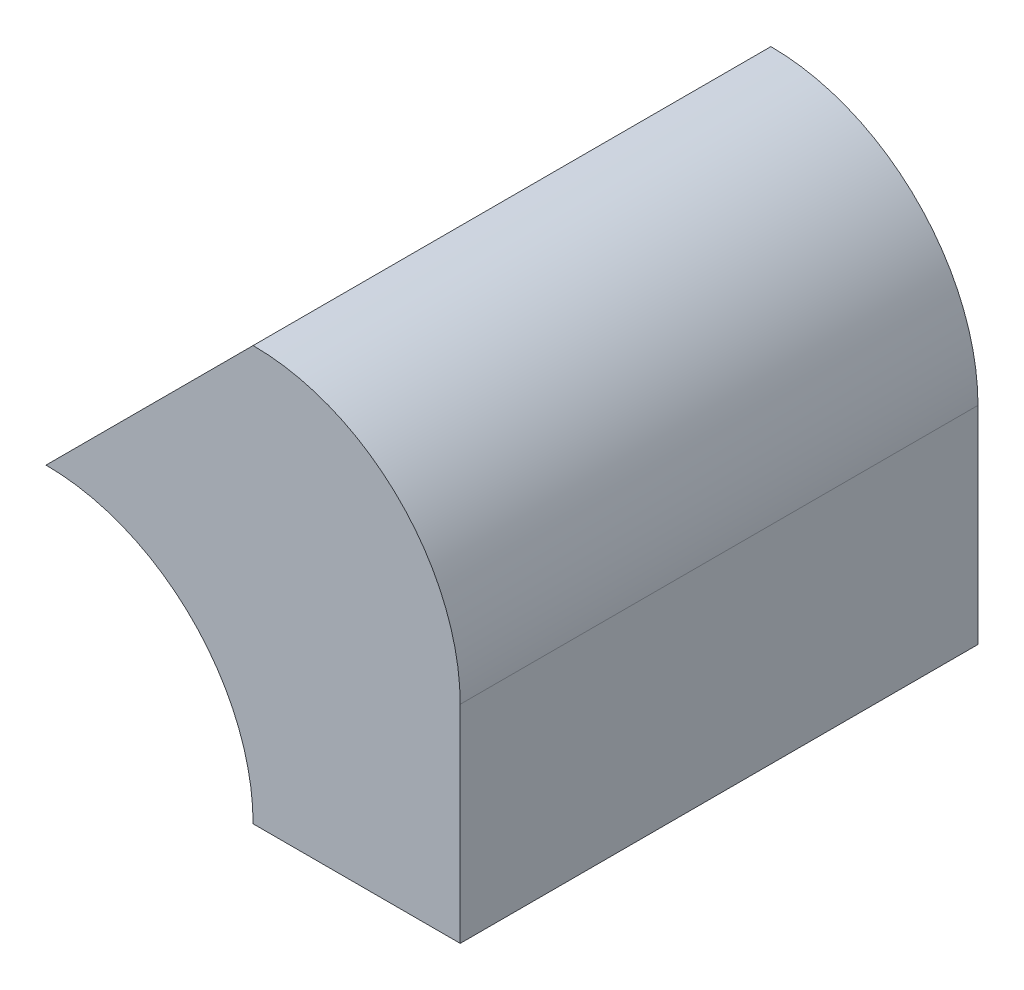
ISO-10303-21;
HEADER;
FILE_DESCRIPTION(('STEP AP214'),'2;1');
FILE_NAME('part.step','',(''),(''),'','','');
FILE_SCHEMA(('AUTOMOTIVE_DESIGN { 1 0 10303 214 1 1 1 1 }'));
ENDSEC;
DATA;
#1=APPLICATION_CONTEXT('core data for automotive mechanical design processes');
#2=APPLICATION_PROTOCOL_DEFINITION('international standard','automotive_design',2000,#1);
#3=PRODUCT_CONTEXT('',#1,'mechanical');
#4=PRODUCT('Part','Part','',(#3));
#5=PRODUCT_RELATED_PRODUCT_CATEGORY('part','',(#4));
#6=PRODUCT_DEFINITION_FORMATION('','',#4);
#7=PRODUCT_DEFINITION_CONTEXT('part definition',#1,'design');
#8=PRODUCT_DEFINITION('design','',#6,#7);
#9=PRODUCT_DEFINITION_SHAPE('','',#8);
#10=(LENGTH_UNIT() NAMED_UNIT(*) SI_UNIT(.MILLI.,.METRE.));
#11=(NAMED_UNIT(*) PLANE_ANGLE_UNIT() SI_UNIT($,.RADIAN.));
#12=(NAMED_UNIT(*) SI_UNIT($,.STERADIAN.) SOLID_ANGLE_UNIT());
#13=UNCERTAINTY_MEASURE_WITH_UNIT(LENGTH_MEASURE(1.E-05),#10,'distance_accuracy_value','');
#14=(GEOMETRIC_REPRESENTATION_CONTEXT(3) GLOBAL_UNCERTAINTY_ASSIGNED_CONTEXT((#13)) GLOBAL_UNIT_ASSIGNED_CONTEXT((#10,
#11,#12)) REPRESENTATION_CONTEXT('',''));
#15=CARTESIAN_POINT('',(0.,0.,0.));
#16=DIRECTION('',(0.,0.,1.));
#17=DIRECTION('',(1.,0.,0.));
#18=AXIS2_PLACEMENT_3D('',#15,#16,#17);
#19=CARTESIAN_POINT('',(-20.,0.,25.));
#20=DIRECTION('',(0.,0.,-1.));
#21=DIRECTION('',(-1.,0.,0.));
#22=AXIS2_PLACEMENT_3D('',#19,#20,#21);
#23=CYLINDRICAL_SURFACE('',#22,10.);
#24=CARTESIAN_POINT('',(-20.,0.,0.));
#25=DIRECTION('',(0.,0.,-1.));
#26=DIRECTION('',(1.,0.,0.));
#27=AXIS2_PLACEMENT_3D('',#24,#25,#26);
#28=CIRCLE('',#27,10.);
#29=CARTESIAN_POINT('',(-20.,10.,0.));
#30=VERTEX_POINT('',#29);
#31=CARTESIAN_POINT('',(-10.,0.,0.));
#32=VERTEX_POINT('',#31);
#33=EDGE_CURVE('E107',#30,#32,#28,.T.);
#34=ORIENTED_EDGE('',*,*,#33,.T.);
#35=DIRECTION('',(0.,0.,-1.));
#36=VECTOR('',#35,1.);
#37=CARTESIAN_POINT('',(-10.,0.,25.));
#38=LINE('',#37,#36);
#39=CARTESIAN_POINT('',(-10.,0.,25.));
#40=VERTEX_POINT('',#39);
#41=EDGE_CURVE('E11',#40,#32,#38,.T.);
#42=ORIENTED_EDGE('',*,*,#41,.F.);
#43=CARTESIAN_POINT('',(-20.,0.,25.));
#44=DIRECTION('',(0.,0.,-1.));
#45=DIRECTION('',(1.,0.,0.));
#46=AXIS2_PLACEMENT_3D('',#43,#44,#45);
#47=CIRCLE('',#46,10.);
#48=CARTESIAN_POINT('',(-20.,10.,25.));
#49=VERTEX_POINT('',#48);
#50=EDGE_CURVE('E115',#49,#40,#47,.T.);
#51=ORIENTED_EDGE('',*,*,#50,.F.);
#52=DIRECTION('',(0.,0.,-1.));
#53=VECTOR('',#52,1.);
#54=CARTESIAN_POINT('',(-20.,10.,25.));
#55=LINE('',#54,#53);
#56=EDGE_CURVE('E103',#49,#30,#55,.T.);
#57=ORIENTED_EDGE('',*,*,#56,.T.);
#58=EDGE_LOOP('',(#34,#42,#51,#57));
#59=FACE_BOUND('',#58,.T.);
#60=ADVANCED_FACE('F33',(#59),#23,.F.);
#61=CARTESIAN_POINT('',(-10.,0.,25.));
#62=DIRECTION('',(0.,1.,0.));
#63=DIRECTION('',(0.,0.,1.));
#64=AXIS2_PLACEMENT_3D('',#61,#62,#63);
#65=PLANE('',#64);
#66=DIRECTION('',(1.,0.,0.));
#67=VECTOR('',#66,1.);
#68=CARTESIAN_POINT('',(-10.,0.,0.));
#69=LINE('',#68,#67);
#70=CARTESIAN_POINT('',(0.,0.,0.));
#71=VERTEX_POINT('',#70);
#72=EDGE_CURVE('E110',#32,#71,#69,.T.);
#73=ORIENTED_EDGE('',*,*,#72,.T.);
#74=DIRECTION('',(0.,0.,-1.));
#75=VECTOR('',#74,1.);
#76=CARTESIAN_POINT('',(0.,0.,25.));
#77=LINE('',#76,#75);
#78=CARTESIAN_POINT('',(0.,0.,25.));
#79=VERTEX_POINT('',#78);
#80=EDGE_CURVE('E41',#79,#71,#77,.T.);
#81=ORIENTED_EDGE('',*,*,#80,.F.);
#82=DIRECTION('',(1.,0.,0.));
#83=VECTOR('',#82,1.);
#84=CARTESIAN_POINT('',(-10.,0.,25.));
#85=LINE('',#84,#83);
#86=EDGE_CURVE('E83',#40,#79,#85,.T.);
#87=ORIENTED_EDGE('',*,*,#86,.F.);
#88=ORIENTED_EDGE('',*,*,#41,.T.);
#89=EDGE_LOOP('',(#73,#81,#87,#88));
#90=FACE_BOUND('',#89,.T.);
#91=ADVANCED_FACE('F134',(#90),#65,.F.);
#92=CARTESIAN_POINT('',(0.,0.,25.));
#93=DIRECTION('',(-1.,0.,0.));
#94=DIRECTION('',(0.,0.,1.));
#95=AXIS2_PLACEMENT_3D('',#92,#93,#94);
#96=PLANE('',#95);
#97=DIRECTION('',(0.,1.,0.));
#98=VECTOR('',#97,1.);
#99=CARTESIAN_POINT('',(0.,0.,0.));
#100=LINE('',#99,#98);
#101=CARTESIAN_POINT('',(0.,10.,0.));
#102=VERTEX_POINT('',#101);
#103=EDGE_CURVE('E98',#71,#102,#100,.T.);
#104=ORIENTED_EDGE('',*,*,#103,.T.);
#105=DIRECTION('',(0.,0.,-1.));
#106=VECTOR('',#105,1.);
#107=CARTESIAN_POINT('',(0.,10.,25.));
#108=LINE('',#107,#106);
#109=CARTESIAN_POINT('',(0.,10.,25.));
#110=VERTEX_POINT('',#109);
#111=EDGE_CURVE('E95',#110,#102,#108,.T.);
#112=ORIENTED_EDGE('',*,*,#111,.F.);
#113=DIRECTION('',(0.,1.,0.));
#114=VECTOR('',#113,1.);
#115=CARTESIAN_POINT('',(0.,0.,25.));
#116=LINE('',#115,#114);
#117=EDGE_CURVE('E87',#79,#110,#116,.T.);
#118=ORIENTED_EDGE('',*,*,#117,.F.);
#119=ORIENTED_EDGE('',*,*,#80,.T.);
#120=EDGE_LOOP('',(#104,#112,#118,#119));
#121=FACE_BOUND('',#120,.T.);
#122=ADVANCED_FACE('F96',(#121),#96,.F.);
#123=CARTESIAN_POINT('',(-10.,10.,25.));
#124=DIRECTION('',(0.,0.,-1.));
#125=DIRECTION('',(-1.,0.,0.));
#126=AXIS2_PLACEMENT_3D('',#123,#124,#125);
#127=CYLINDRICAL_SURFACE('',#126,10.);
#128=CARTESIAN_POINT('',(-10.,10.,0.));
#129=DIRECTION('',(0.,0.,1.));
#130=DIRECTION('',(1.,0.,0.));
#131=AXIS2_PLACEMENT_3D('',#128,#129,#130);
#132=CIRCLE('',#131,10.);
#133=CARTESIAN_POINT('',(-10.,20.,0.));
#134=VERTEX_POINT('',#133);
#135=EDGE_CURVE('E69',#102,#134,#132,.T.);
#136=ORIENTED_EDGE('',*,*,#135,.T.);
#137=DIRECTION('',(0.,0.,-1.));
#138=VECTOR('',#137,1.);
#139=CARTESIAN_POINT('',(-10.,20.,25.));
#140=LINE('',#139,#138);
#141=CARTESIAN_POINT('',(-10.,20.,25.));
#142=VERTEX_POINT('',#141);
#143=EDGE_CURVE('E99',#142,#134,#140,.T.);
#144=ORIENTED_EDGE('',*,*,#143,.F.);
#145=CARTESIAN_POINT('',(-10.,10.,25.));
#146=DIRECTION('',(0.,0.,1.));
#147=DIRECTION('',(1.,0.,0.));
#148=AXIS2_PLACEMENT_3D('',#145,#146,#147);
#149=CIRCLE('',#148,10.);
#150=EDGE_CURVE('E91',#110,#142,#149,.T.);
#151=ORIENTED_EDGE('',*,*,#150,.F.);
#152=ORIENTED_EDGE('',*,*,#111,.T.);
#153=EDGE_LOOP('',(#136,#144,#151,#152));
#154=FACE_BOUND('',#153,.T.);
#155=ADVANCED_FACE('F101',(#154),#127,.T.);
#156=CARTESIAN_POINT('',(-20.,10.,25.));
#157=DIRECTION('',(0.707106781186548,-0.707106781186548,0.));
#158=DIRECTION('',(0.707106781186548,0.707106781186548,0.));
#159=AXIS2_PLACEMENT_3D('',#156,#157,#158);
#160=PLANE('',#159);
#161=DIRECTION('',(-0.707106781186548,-0.707106781186548,0.));
#162=VECTOR('',#161,1.);
#163=CARTESIAN_POINT('',(-20.,10.,0.));
#164=LINE('',#163,#162);
#165=EDGE_CURVE('E75',#134,#30,#164,.T.);
#166=ORIENTED_EDGE('',*,*,#165,.T.);
#167=ORIENTED_EDGE('',*,*,#56,.F.);
#168=DIRECTION('',(-0.707106781186548,-0.707106781186548,0.));
#169=VECTOR('',#168,1.);
#170=CARTESIAN_POINT('',(-20.,10.,25.));
#171=LINE('',#170,#169);
#172=EDGE_CURVE('E49',#142,#49,#171,.T.);
#173=ORIENTED_EDGE('',*,*,#172,.F.);
#174=ORIENTED_EDGE('',*,*,#143,.T.);
#175=EDGE_LOOP('',(#166,#167,#173,#174));
#176=FACE_BOUND('',#175,.T.);
#177=ADVANCED_FACE('F123',(#176),#160,.F.);
#178=CARTESIAN_POINT('',(-20.,0.,25.));
#179=DIRECTION('',(0.,0.,1.));
#180=DIRECTION('',(1.,0.,0.));
#181=AXIS2_PLACEMENT_3D('',#178,#179,#180);
#182=PLANE('',#181);
#183=ORIENTED_EDGE('',*,*,#50,.T.);
#184=ORIENTED_EDGE('',*,*,#86,.T.);
#185=ORIENTED_EDGE('',*,*,#117,.T.);
#186=ORIENTED_EDGE('',*,*,#150,.T.);
#187=ORIENTED_EDGE('',*,*,#172,.T.);
#188=EDGE_LOOP('',(#183,#184,#185,#186,#187));
#189=FACE_BOUND('',#188,.T.);
#190=ADVANCED_FACE('F89',(#189),#182,.T.);
#191=CARTESIAN_POINT('',(-20.,0.,0.));
#192=DIRECTION('',(0.,0.,1.));
#193=DIRECTION('',(1.,0.,0.));
#194=AXIS2_PLACEMENT_3D('',#191,#192,#193);
#195=PLANE('',#194);
#196=ORIENTED_EDGE('',*,*,#33,.F.);
#197=ORIENTED_EDGE('',*,*,#165,.F.);
#198=ORIENTED_EDGE('',*,*,#135,.F.);
#199=ORIENTED_EDGE('',*,*,#103,.F.);
#200=ORIENTED_EDGE('',*,*,#72,.F.);
#201=EDGE_LOOP('',(#196,#197,#198,#199,#200));
#202=FACE_BOUND('',#201,.T.);
#203=ADVANCED_FACE('F119',(#202),#195,.F.);
#204=CLOSED_SHELL('',(#60,#91,#122,#155,#177,#190,#203));
#205=MANIFOLD_SOLID_BREP('B2',#204);
#206=ADVANCED_BREP_SHAPE_REPRESENTATION('',(#18,#205),#14);
#207=SHAPE_DEFINITION_REPRESENTATION(#9,#206);
ENDSEC;
END-ISO-10303-21;
